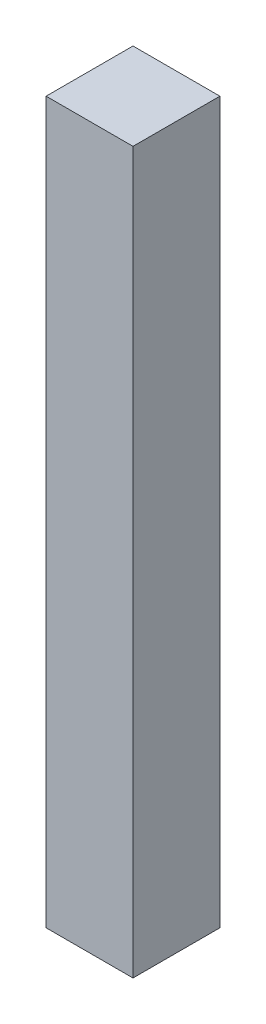
ISO-10303-21;
HEADER;
FILE_DESCRIPTION(('STEP AP214'),'2;1');
FILE_NAME('part.step','',(''),(''),'','','');
FILE_SCHEMA(('AUTOMOTIVE_DESIGN { 1 0 10303 214 1 1 1 1 }'));
ENDSEC;
DATA;
#1=APPLICATION_CONTEXT('core data for automotive mechanical design processes');
#2=APPLICATION_PROTOCOL_DEFINITION('international standard','automotive_design',2000,#1);
#3=PRODUCT_CONTEXT('',#1,'mechanical');
#4=PRODUCT('Part','Part','',(#3));
#5=PRODUCT_RELATED_PRODUCT_CATEGORY('part','',(#4));
#6=PRODUCT_DEFINITION_FORMATION('','',#4);
#7=PRODUCT_DEFINITION_CONTEXT('part definition',#1,'design');
#8=PRODUCT_DEFINITION('design','',#6,#7);
#9=PRODUCT_DEFINITION_SHAPE('','',#8);
#10=(LENGTH_UNIT() NAMED_UNIT(*) SI_UNIT(.MILLI.,.METRE.));
#11=(NAMED_UNIT(*) PLANE_ANGLE_UNIT() SI_UNIT($,.RADIAN.));
#12=(NAMED_UNIT(*) SI_UNIT($,.STERADIAN.) SOLID_ANGLE_UNIT());
#13=UNCERTAINTY_MEASURE_WITH_UNIT(LENGTH_MEASURE(1.E-05),#10,'distance_accuracy_value','');
#14=(GEOMETRIC_REPRESENTATION_CONTEXT(3) GLOBAL_UNCERTAINTY_ASSIGNED_CONTEXT((#13)) GLOBAL_UNIT_ASSIGNED_CONTEXT((#10,
#11,#12)) REPRESENTATION_CONTEXT('',''));
#15=CARTESIAN_POINT('',(0.,0.,0.));
#16=DIRECTION('',(0.,0.,1.));
#17=DIRECTION('',(1.,0.,0.));
#18=AXIS2_PLACEMENT_3D('',#15,#16,#17);
#19=CARTESIAN_POINT('',(-295.,18.,250.));
#20=DIRECTION('',(-1.,0.,0.));
#21=DIRECTION('',(0.,0.,1.));
#22=AXIS2_PLACEMENT_3D('',#19,#20,#21);
#23=PLANE('',#22);
#24=DIRECTION('',(0.,0.,1.));
#25=VECTOR('',#24,1.);
#26=CARTESIAN_POINT('',(-295.,418.,272.5));
#27=LINE('',#26,#25);
#28=CARTESIAN_POINT('',(-295.,418.,250.));
#29=VERTEX_POINT('',#28);
#30=CARTESIAN_POINT('',(-295.,418.,295.));
#31=VERTEX_POINT('',#30);
#32=EDGE_CURVE('E68',#29,#31,#27,.T.);
#33=ORIENTED_EDGE('',*,*,#32,.F.);
#34=DIRECTION('',(0.,1.,0.));
#35=VECTOR('',#34,1.);
#36=CARTESIAN_POINT('',(-295.,18.,250.));
#37=LINE('',#36,#35);
#38=CARTESIAN_POINT('',(-295.,45.,250.));
#39=VERTEX_POINT('',#38);
#40=EDGE_CURVE('E55',#39,#29,#37,.T.);
#41=ORIENTED_EDGE('',*,*,#40,.F.);
#42=DIRECTION('',(0.,0.,1.));
#43=VECTOR('',#42,1.);
#44=CARTESIAN_POINT('',(-295.,45.,272.5));
#45=LINE('',#44,#43);
#46=CARTESIAN_POINT('',(-295.,45.,295.));
#47=VERTEX_POINT('',#46);
#48=EDGE_CURVE('E20',#39,#47,#45,.T.);
#49=ORIENTED_EDGE('',*,*,#48,.T.);
#50=DIRECTION('',(0.,1.,0.));
#51=VECTOR('',#50,1.);
#52=CARTESIAN_POINT('',(-295.,18.,295.));
#53=LINE('',#52,#51);
#54=EDGE_CURVE('E81',#31,#47,#53,.F.);
#55=ORIENTED_EDGE('',*,*,#54,.F.);
#56=EDGE_LOOP('',(#33,#41,#49,#55));
#57=FACE_BOUND('',#56,.T.);
#58=ADVANCED_FACE('F17',(#57),#23,.T.);
#59=CARTESIAN_POINT('',(-272.5,45.,272.5));
#60=DIRECTION('',(0.,1.,0.));
#61=DIRECTION('',(0.,0.,1.));
#62=AXIS2_PLACEMENT_3D('',#59,#60,#61);
#63=PLANE('',#62);
#64=DIRECTION('',(0.,0.,-1.));
#65=VECTOR('',#64,1.);
#66=CARTESIAN_POINT('',(-250.,45.,295.));
#67=LINE('',#66,#65);
#68=CARTESIAN_POINT('',(-250.,45.,295.));
#69=VERTEX_POINT('',#68);
#70=CARTESIAN_POINT('',(-250.,45.,250.));
#71=VERTEX_POINT('',#70);
#72=EDGE_CURVE('E83',#69,#71,#67,.T.);
#73=ORIENTED_EDGE('',*,*,#72,.F.);
#74=DIRECTION('',(1.,0.,0.));
#75=VECTOR('',#74,1.);
#76=CARTESIAN_POINT('',(-295.,45.,295.));
#77=LINE('',#76,#75);
#78=EDGE_CURVE('E64',#47,#69,#77,.T.);
#79=ORIENTED_EDGE('',*,*,#78,.F.);
#80=ORIENTED_EDGE('',*,*,#48,.F.);
#81=DIRECTION('',(-1.,0.,0.));
#82=VECTOR('',#81,1.);
#83=CARTESIAN_POINT('',(-250.,45.,250.));
#84=LINE('',#83,#82);
#85=EDGE_CURVE('E61',#71,#39,#84,.T.);
#86=ORIENTED_EDGE('',*,*,#85,.F.);
#87=EDGE_LOOP('',(#73,#79,#80,#86));
#88=FACE_BOUND('',#87,.T.);
#89=ADVANCED_FACE('F60',(#88),#63,.F.);
#90=CARTESIAN_POINT('',(-250.,18.,250.));
#91=DIRECTION('',(0.,0.,-1.));
#92=DIRECTION('',(-1.,0.,0.));
#93=AXIS2_PLACEMENT_3D('',#90,#91,#92);
#94=PLANE('',#93);
#95=DIRECTION('',(1.,0.,0.));
#96=VECTOR('',#95,1.);
#97=CARTESIAN_POINT('',(-272.5,418.,250.));
#98=LINE('',#97,#96);
#99=CARTESIAN_POINT('',(-250.,418.,250.));
#100=VERTEX_POINT('',#99);
#101=EDGE_CURVE('E70',#100,#29,#98,.F.);
#102=ORIENTED_EDGE('',*,*,#101,.F.);
#103=DIRECTION('',(0.,1.,0.));
#104=VECTOR('',#103,1.);
#105=CARTESIAN_POINT('',(-250.,18.,250.));
#106=LINE('',#105,#104);
#107=EDGE_CURVE('E74',#71,#100,#106,.T.);
#108=ORIENTED_EDGE('',*,*,#107,.F.);
#109=ORIENTED_EDGE('',*,*,#85,.T.);
#110=ORIENTED_EDGE('',*,*,#40,.T.);
#111=EDGE_LOOP('',(#102,#108,#109,#110));
#112=FACE_BOUND('',#111,.T.);
#113=ADVANCED_FACE('F72',(#112),#94,.T.);
#114=CARTESIAN_POINT('',(-272.5,418.,272.5));
#115=DIRECTION('',(0.,1.,0.));
#116=DIRECTION('',(0.,0.,1.));
#117=AXIS2_PLACEMENT_3D('',#114,#115,#116);
#118=PLANE('',#117);
#119=DIRECTION('',(1.,0.,0.));
#120=VECTOR('',#119,1.);
#121=CARTESIAN_POINT('',(-295.,418.,295.));
#122=LINE('',#121,#120);
#123=CARTESIAN_POINT('',(-250.,418.,295.));
#124=VERTEX_POINT('',#123);
#125=EDGE_CURVE('E35',#124,#31,#122,.F.);
#126=ORIENTED_EDGE('',*,*,#125,.F.);
#127=DIRECTION('',(0.,0.,-1.));
#128=VECTOR('',#127,1.);
#129=CARTESIAN_POINT('',(-250.,418.,295.));
#130=LINE('',#129,#128);
#131=EDGE_CURVE('E26',#100,#124,#130,.F.);
#132=ORIENTED_EDGE('',*,*,#131,.F.);
#133=ORIENTED_EDGE('',*,*,#101,.T.);
#134=ORIENTED_EDGE('',*,*,#32,.T.);
#135=EDGE_LOOP('',(#126,#132,#133,#134));
#136=FACE_BOUND('',#135,.T.);
#137=ADVANCED_FACE('F89',(#136),#118,.T.);
#138=CARTESIAN_POINT('',(-295.,18.,295.));
#139=DIRECTION('',(0.,0.,1.));
#140=DIRECTION('',(1.,0.,0.));
#141=AXIS2_PLACEMENT_3D('',#138,#139,#140);
#142=PLANE('',#141);
#143=ORIENTED_EDGE('',*,*,#125,.T.);
#144=ORIENTED_EDGE('',*,*,#54,.T.);
#145=ORIENTED_EDGE('',*,*,#78,.T.);
#146=DIRECTION('',(0.,1.,0.));
#147=VECTOR('',#146,1.);
#148=CARTESIAN_POINT('',(-250.,18.,295.));
#149=LINE('',#148,#147);
#150=EDGE_CURVE('E11',#124,#69,#149,.F.);
#151=ORIENTED_EDGE('',*,*,#150,.F.);
#152=EDGE_LOOP('',(#143,#144,#145,#151));
#153=FACE_BOUND('',#152,.T.);
#154=ADVANCED_FACE('F91',(#153),#142,.T.);
#155=CARTESIAN_POINT('',(-250.,18.,295.));
#156=DIRECTION('',(1.,0.,0.));
#157=DIRECTION('',(0.,0.,-1.));
#158=AXIS2_PLACEMENT_3D('',#155,#156,#157);
#159=PLANE('',#158);
#160=ORIENTED_EDGE('',*,*,#131,.T.);
#161=ORIENTED_EDGE('',*,*,#150,.T.);
#162=ORIENTED_EDGE('',*,*,#72,.T.);
#163=ORIENTED_EDGE('',*,*,#107,.T.);
#164=EDGE_LOOP('',(#160,#161,#162,#163));
#165=FACE_BOUND('',#164,.T.);
#166=ADVANCED_FACE('F88',(#165),#159,.T.);
#167=CLOSED_SHELL('',(#58,#89,#113,#137,#154,#166));
#168=MANIFOLD_SOLID_BREP('B1',#167);
#169=ADVANCED_BREP_SHAPE_REPRESENTATION('',(#18,#168),#14);
#170=SHAPE_DEFINITION_REPRESENTATION(#9,#169);
ENDSEC;
END-ISO-10303-21;
